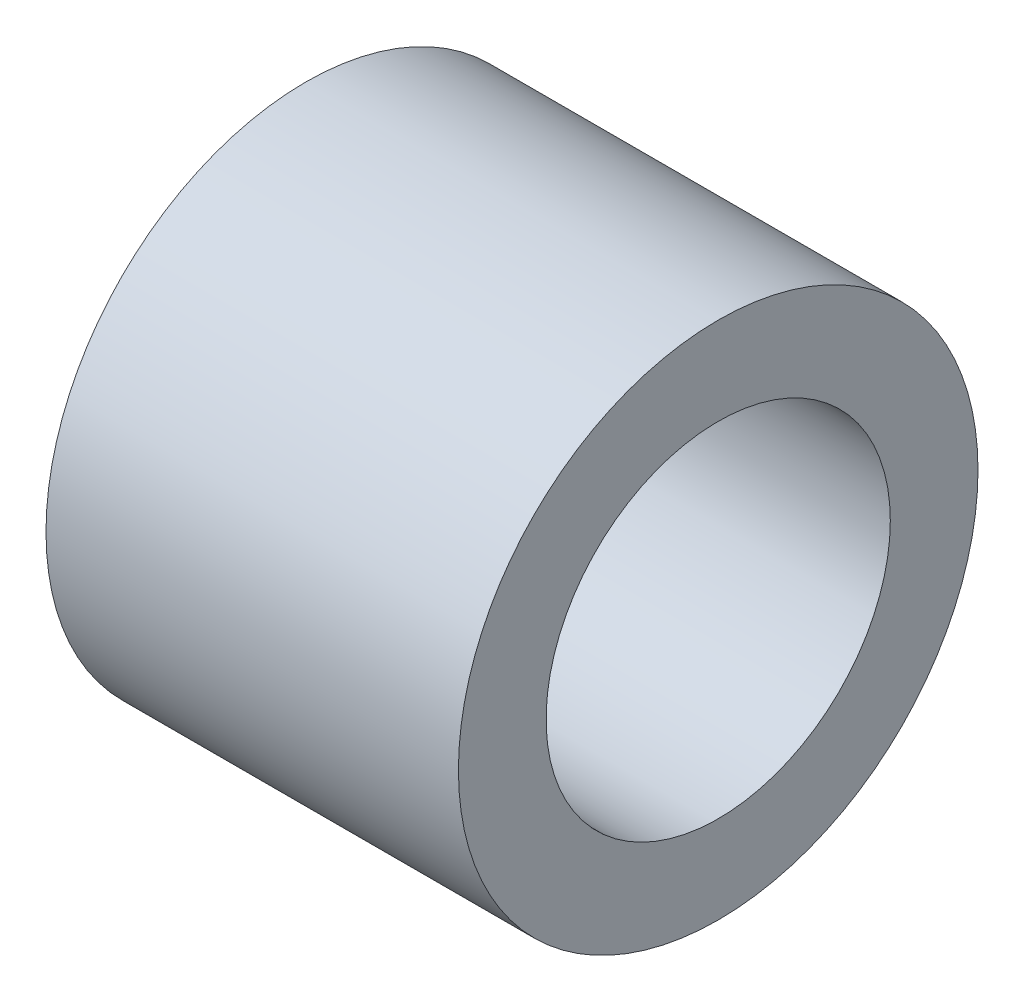
ISO-10303-21;
HEADER;
FILE_DESCRIPTION(('STEP AP214'),'2;1');
FILE_NAME('part.step','',(''),(''),'','','');
FILE_SCHEMA(('AUTOMOTIVE_DESIGN { 1 0 10303 214 1 1 1 1 }'));
ENDSEC;
DATA;
#1=APPLICATION_CONTEXT('core data for automotive mechanical design processes');
#2=APPLICATION_PROTOCOL_DEFINITION('international standard','automotive_design',2000,#1);
#3=PRODUCT_CONTEXT('',#1,'mechanical');
#4=PRODUCT('Part','Part','',(#3));
#5=PRODUCT_RELATED_PRODUCT_CATEGORY('part','',(#4));
#6=PRODUCT_DEFINITION_FORMATION('','',#4);
#7=PRODUCT_DEFINITION_CONTEXT('part definition',#1,'design');
#8=PRODUCT_DEFINITION('design','',#6,#7);
#9=PRODUCT_DEFINITION_SHAPE('','',#8);
#10=(LENGTH_UNIT() NAMED_UNIT(*) SI_UNIT(.MILLI.,.METRE.));
#11=(NAMED_UNIT(*) PLANE_ANGLE_UNIT() SI_UNIT($,.RADIAN.));
#12=(NAMED_UNIT(*) SI_UNIT($,.STERADIAN.) SOLID_ANGLE_UNIT());
#13=UNCERTAINTY_MEASURE_WITH_UNIT(LENGTH_MEASURE(1.E-05),#10,'distance_accuracy_value','');
#14=(GEOMETRIC_REPRESENTATION_CONTEXT(3) GLOBAL_UNCERTAINTY_ASSIGNED_CONTEXT((#13)) GLOBAL_UNIT_ASSIGNED_CONTEXT((#10,
#11,#12)) REPRESENTATION_CONTEXT('',''));
#15=CARTESIAN_POINT('',(0.,0.,0.));
#16=DIRECTION('',(0.,0.,1.));
#17=DIRECTION('',(1.,0.,0.));
#18=AXIS2_PLACEMENT_3D('',#15,#16,#17);
#19=CARTESIAN_POINT('',(6.35,0.,0.));
#20=DIRECTION('',(1.,0.,0.));
#21=DIRECTION('',(0.,0.,-1.));
#22=AXIS2_PLACEMENT_3D('',#19,#20,#21);
#23=PLANE('',#22);
#24=CARTESIAN_POINT('',(6.35,0.,0.));
#25=DIRECTION('',(1.,0.,0.));
#26=DIRECTION('',(0.,0.,-1.));
#27=AXIS2_PLACEMENT_3D('',#24,#25,#26);
#28=CIRCLE('',#27,4.);
#29=CARTESIAN_POINT('',(6.35,0.,-4.));
#30=VERTEX_POINT('',#29);
#31=EDGE_CURVE('E10',#30,#30,#28,.T.);
#32=ORIENTED_EDGE('',*,*,#31,.T.);
#33=EDGE_LOOP('',(#32));
#34=FACE_BOUND('',#33,.T.);
#35=CARTESIAN_POINT('',(6.35,0.,0.));
#36=DIRECTION('',(1.,0.,0.));
#37=DIRECTION('',(0.,0.,-1.));
#38=AXIS2_PLACEMENT_3D('',#35,#36,#37);
#39=CIRCLE('',#38,2.65);
#40=CARTESIAN_POINT('',(6.35,0.,-2.65));
#41=VERTEX_POINT('',#40);
#42=EDGE_CURVE('E41',#41,#41,#39,.T.);
#43=ORIENTED_EDGE('',*,*,#42,.F.);
#44=EDGE_LOOP('',(#43));
#45=FACE_BOUND('',#44,.T.);
#46=ADVANCED_FACE('F30',(#34,#45),#23,.T.);
#47=CARTESIAN_POINT('',(0.,0.,0.));
#48=DIRECTION('',(1.,0.,0.));
#49=DIRECTION('',(0.,0.,-1.));
#50=AXIS2_PLACEMENT_3D('',#47,#48,#49);
#51=PLANE('',#50);
#52=CARTESIAN_POINT('',(0.,0.,0.));
#53=DIRECTION('',(1.,0.,0.));
#54=DIRECTION('',(0.,0.,-1.));
#55=AXIS2_PLACEMENT_3D('',#52,#53,#54);
#56=CIRCLE('',#55,4.);
#57=CARTESIAN_POINT('',(0.,0.,-4.));
#58=VERTEX_POINT('',#57);
#59=EDGE_CURVE('E34',#58,#58,#56,.T.);
#60=ORIENTED_EDGE('',*,*,#59,.F.);
#61=EDGE_LOOP('',(#60));
#62=FACE_BOUND('',#61,.T.);
#63=CARTESIAN_POINT('',(0.,0.,0.));
#64=DIRECTION('',(1.,0.,0.));
#65=DIRECTION('',(0.,0.,-1.));
#66=AXIS2_PLACEMENT_3D('',#63,#64,#65);
#67=CIRCLE('',#66,2.65);
#68=CARTESIAN_POINT('',(0.,0.,-2.65));
#69=VERTEX_POINT('',#68);
#70=EDGE_CURVE('E43',#69,#69,#67,.T.);
#71=ORIENTED_EDGE('',*,*,#70,.T.);
#72=EDGE_LOOP('',(#71));
#73=FACE_BOUND('',#72,.T.);
#74=ADVANCED_FACE('F53',(#62,#73),#51,.F.);
#75=CARTESIAN_POINT('',(6.35,0.,0.));
#76=DIRECTION('',(-1.,0.,0.));
#77=DIRECTION('',(0.,0.,1.));
#78=AXIS2_PLACEMENT_3D('',#75,#76,#77);
#79=CYLINDRICAL_SURFACE('',#78,4.);
#80=ORIENTED_EDGE('',*,*,#31,.F.);
#81=EDGE_LOOP('',(#80));
#82=FACE_BOUND('',#81,.T.);
#83=ORIENTED_EDGE('',*,*,#59,.T.);
#84=EDGE_LOOP('',(#83));
#85=FACE_BOUND('',#84,.T.);
#86=ADVANCED_FACE('F32',(#82,#85),#79,.T.);
#87=CARTESIAN_POINT('',(6.35,0.,0.));
#88=DIRECTION('',(-1.,0.,0.));
#89=DIRECTION('',(0.,0.,1.));
#90=AXIS2_PLACEMENT_3D('',#87,#88,#89);
#91=CYLINDRICAL_SURFACE('',#90,2.65);
#92=ORIENTED_EDGE('',*,*,#42,.T.);
#93=EDGE_LOOP('',(#92));
#94=FACE_BOUND('',#93,.T.);
#95=ORIENTED_EDGE('',*,*,#70,.F.);
#96=EDGE_LOOP('',(#95));
#97=FACE_BOUND('',#96,.T.);
#98=ADVANCED_FACE('F49',(#94,#97),#91,.F.);
#99=CLOSED_SHELL('',(#46,#74,#86,#98));
#100=MANIFOLD_SOLID_BREP('B2',#99);
#101=ADVANCED_BREP_SHAPE_REPRESENTATION('',(#18,#100),#14);
#102=SHAPE_DEFINITION_REPRESENTATION(#9,#101);
ENDSEC;
END-ISO-10303-21;
